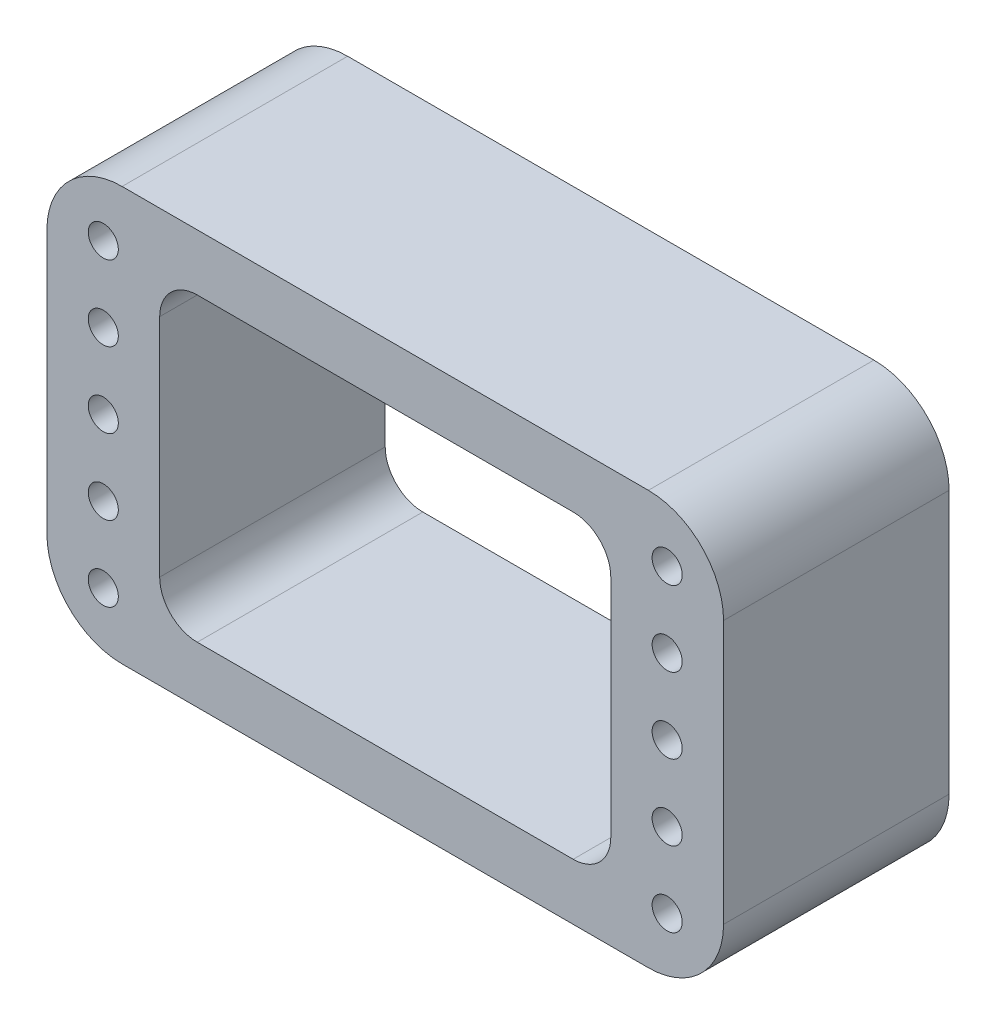
ISO-10303-21;
HEADER;
FILE_DESCRIPTION(('STEP AP214'),'2;1');
FILE_NAME('part.step','',(''),(''),'','','');
FILE_SCHEMA(('AUTOMOTIVE_DESIGN { 1 0 10303 214 1 1 1 1 }'));
ENDSEC;
DATA;
#1=APPLICATION_CONTEXT('core data for automotive mechanical design processes');
#2=APPLICATION_PROTOCOL_DEFINITION('international standard','automotive_design',2000,#1);
#3=PRODUCT_CONTEXT('',#1,'mechanical');
#4=PRODUCT('Part','Part','',(#3));
#5=PRODUCT_RELATED_PRODUCT_CATEGORY('part','',(#4));
#6=PRODUCT_DEFINITION_FORMATION('','',#4);
#7=PRODUCT_DEFINITION_CONTEXT('part definition',#1,'design');
#8=PRODUCT_DEFINITION('design','',#6,#7);
#9=PRODUCT_DEFINITION_SHAPE('','',#8);
#10=(LENGTH_UNIT() NAMED_UNIT(*) SI_UNIT(.MILLI.,.METRE.));
#11=(NAMED_UNIT(*) PLANE_ANGLE_UNIT() SI_UNIT($,.RADIAN.));
#12=(NAMED_UNIT(*) SI_UNIT($,.STERADIAN.) SOLID_ANGLE_UNIT());
#13=UNCERTAINTY_MEASURE_WITH_UNIT(LENGTH_MEASURE(1.E-05),#10,'distance_accuracy_value','');
#14=(GEOMETRIC_REPRESENTATION_CONTEXT(3) GLOBAL_UNCERTAINTY_ASSIGNED_CONTEXT((#13)) GLOBAL_UNIT_ASSIGNED_CONTEXT((#10,
#11,#12)) REPRESENTATION_CONTEXT('',''));
#15=CARTESIAN_POINT('',(0.,0.,0.));
#16=DIRECTION('',(0.,0.,1.));
#17=DIRECTION('',(1.,0.,0.));
#18=AXIS2_PLACEMENT_3D('',#15,#16,#17);
#19=CARTESIAN_POINT('',(45.,27.5,30.));
#20=DIRECTION('',(-1.,0.,0.));
#21=DIRECTION('',(0.,-1.,0.));
#22=AXIS2_PLACEMENT_3D('',#19,#20,#21);
#23=PLANE('',#22);
#24=DIRECTION('',(0.,1.,0.));
#25=VECTOR('',#24,1.);
#26=CARTESIAN_POINT('',(45.,27.5,0.));
#27=LINE('',#26,#25);
#28=CARTESIAN_POINT('',(45.,-17.5,0.));
#29=VERTEX_POINT('',#28);
#30=CARTESIAN_POINT('',(45.,17.5,0.));
#31=VERTEX_POINT('',#30);
#32=EDGE_CURVE('E197',#29,#31,#27,.T.);
#33=ORIENTED_EDGE('',*,*,#32,.T.);
#34=DIRECTION('',(0.,0.,-1.));
#35=VECTOR('',#34,1.);
#36=CARTESIAN_POINT('',(45.,17.5,30.));
#37=LINE('',#36,#35);
#38=CARTESIAN_POINT('',(45.,17.5,30.));
#39=VERTEX_POINT('',#38);
#40=EDGE_CURVE('E239',#31,#39,#37,.F.);
#41=ORIENTED_EDGE('',*,*,#40,.T.);
#42=DIRECTION('',(0.,1.,0.));
#43=VECTOR('',#42,1.);
#44=CARTESIAN_POINT('',(45.,27.5,30.));
#45=LINE('',#44,#43);
#46=CARTESIAN_POINT('',(45.,-17.5,30.));
#47=VERTEX_POINT('',#46);
#48=EDGE_CURVE('E195',#47,#39,#45,.T.);
#49=ORIENTED_EDGE('',*,*,#48,.F.);
#50=DIRECTION('',(0.,0.,-1.));
#51=VECTOR('',#50,1.);
#52=CARTESIAN_POINT('',(45.,-17.5,30.));
#53=LINE('',#52,#51);
#54=EDGE_CURVE('E235',#47,#29,#53,.T.);
#55=ORIENTED_EDGE('',*,*,#54,.T.);
#56=EDGE_LOOP('',(#33,#41,#49,#55));
#57=FACE_BOUND('',#56,.T.);
#58=ADVANCED_FACE('F45',(#57),#23,.F.);
#59=CARTESIAN_POINT('',(-45.,27.5,30.));
#60=DIRECTION('',(0.,-1.,0.));
#61=DIRECTION('',(0.,0.,-1.));
#62=AXIS2_PLACEMENT_3D('',#59,#60,#61);
#63=PLANE('',#62);
#64=DIRECTION('',(-1.,0.,0.));
#65=VECTOR('',#64,1.);
#66=CARTESIAN_POINT('',(-45.,27.5,0.));
#67=LINE('',#66,#65);
#68=CARTESIAN_POINT('',(35.,27.5,0.));
#69=VERTEX_POINT('',#68);
#70=CARTESIAN_POINT('',(-35.,27.5,0.));
#71=VERTEX_POINT('',#70);
#72=EDGE_CURVE('E190',#69,#71,#67,.T.);
#73=ORIENTED_EDGE('',*,*,#72,.T.);
#74=DIRECTION('',(0.,0.,-1.));
#75=VECTOR('',#74,1.);
#76=CARTESIAN_POINT('',(-35.,27.5,30.));
#77=LINE('',#76,#75);
#78=CARTESIAN_POINT('',(-35.,27.5,30.));
#79=VERTEX_POINT('',#78);
#80=EDGE_CURVE('E165',#71,#79,#77,.F.);
#81=ORIENTED_EDGE('',*,*,#80,.T.);
#82=DIRECTION('',(-1.,0.,0.));
#83=VECTOR('',#82,1.);
#84=CARTESIAN_POINT('',(-45.,27.5,30.));
#85=LINE('',#84,#83);
#86=CARTESIAN_POINT('',(35.,27.5,30.));
#87=VERTEX_POINT('',#86);
#88=EDGE_CURVE('E335',#87,#79,#85,.T.);
#89=ORIENTED_EDGE('',*,*,#88,.F.);
#90=DIRECTION('',(0.,0.,-1.));
#91=VECTOR('',#90,1.);
#92=CARTESIAN_POINT('',(35.,27.5,30.));
#93=LINE('',#92,#91);
#94=EDGE_CURVE('E171',#87,#69,#93,.T.);
#95=ORIENTED_EDGE('',*,*,#94,.T.);
#96=EDGE_LOOP('',(#73,#81,#89,#95));
#97=FACE_BOUND('',#96,.T.);
#98=ADVANCED_FACE('F356',(#97),#63,.F.);
#99=CARTESIAN_POINT('',(-45.,27.5,30.));
#100=DIRECTION('',(1.,0.,0.));
#101=DIRECTION('',(0.,1.,0.));
#102=AXIS2_PLACEMENT_3D('',#99,#100,#101);
#103=PLANE('',#102);
#104=DIRECTION('',(0.,-1.,0.));
#105=VECTOR('',#104,1.);
#106=CARTESIAN_POINT('',(-45.,27.5,30.));
#107=LINE('',#106,#105);
#108=CARTESIAN_POINT('',(-45.,17.5,30.));
#109=VERTEX_POINT('',#108);
#110=CARTESIAN_POINT('',(-45.,-17.5,30.));
#111=VERTEX_POINT('',#110);
#112=EDGE_CURVE('E181',#109,#111,#107,.T.);
#113=ORIENTED_EDGE('',*,*,#112,.F.);
#114=DIRECTION('',(0.,0.,-1.));
#115=VECTOR('',#114,1.);
#116=CARTESIAN_POINT('',(-45.,17.5,30.));
#117=LINE('',#116,#115);
#118=CARTESIAN_POINT('',(-45.,17.5,0.));
#119=VERTEX_POINT('',#118);
#120=EDGE_CURVE('E164',#109,#119,#117,.T.);
#121=ORIENTED_EDGE('',*,*,#120,.T.);
#122=DIRECTION('',(0.,-1.,0.));
#123=VECTOR('',#122,1.);
#124=CARTESIAN_POINT('',(-45.,27.5,0.));
#125=LINE('',#124,#123);
#126=CARTESIAN_POINT('',(-45.,-17.5,0.));
#127=VERTEX_POINT('',#126);
#128=EDGE_CURVE('E178',#119,#127,#125,.T.);
#129=ORIENTED_EDGE('',*,*,#128,.T.);
#130=DIRECTION('',(0.,0.,-1.));
#131=VECTOR('',#130,1.);
#132=CARTESIAN_POINT('',(-45.,-17.5,30.));
#133=LINE('',#132,#131);
#134=EDGE_CURVE('E184',#127,#111,#133,.F.);
#135=ORIENTED_EDGE('',*,*,#134,.T.);
#136=EDGE_LOOP('',(#113,#121,#129,#135));
#137=FACE_BOUND('',#136,.T.);
#138=ADVANCED_FACE('F177',(#137),#103,.F.);
#139=CARTESIAN_POINT('',(-45.,-27.5,30.));
#140=DIRECTION('',(0.,1.,0.));
#141=DIRECTION('',(0.,0.,1.));
#142=AXIS2_PLACEMENT_3D('',#139,#140,#141);
#143=PLANE('',#142);
#144=DIRECTION('',(1.,0.,0.));
#145=VECTOR('',#144,1.);
#146=CARTESIAN_POINT('',(-45.,-27.5,30.));
#147=LINE('',#146,#145);
#148=CARTESIAN_POINT('',(-35.,-27.5,30.));
#149=VERTEX_POINT('',#148);
#150=CARTESIAN_POINT('',(35.,-27.5,30.));
#151=VERTEX_POINT('',#150);
#152=EDGE_CURVE('E202',#149,#151,#147,.T.);
#153=ORIENTED_EDGE('',*,*,#152,.F.);
#154=DIRECTION('',(0.,0.,-1.));
#155=VECTOR('',#154,1.);
#156=CARTESIAN_POINT('',(-35.,-27.5,30.));
#157=LINE('',#156,#155);
#158=CARTESIAN_POINT('',(-35.,-27.5,0.));
#159=VERTEX_POINT('',#158);
#160=EDGE_CURVE('E231',#149,#159,#157,.T.);
#161=ORIENTED_EDGE('',*,*,#160,.T.);
#162=DIRECTION('',(1.,0.,0.));
#163=VECTOR('',#162,1.);
#164=CARTESIAN_POINT('',(-45.,-27.5,0.));
#165=LINE('',#164,#163);
#166=CARTESIAN_POINT('',(35.,-27.5,0.));
#167=VERTEX_POINT('',#166);
#168=EDGE_CURVE('E189',#159,#167,#165,.T.);
#169=ORIENTED_EDGE('',*,*,#168,.T.);
#170=DIRECTION('',(0.,0.,-1.));
#171=VECTOR('',#170,1.);
#172=CARTESIAN_POINT('',(35.,-27.5,30.));
#173=LINE('',#172,#171);
#174=EDGE_CURVE('E228',#167,#151,#173,.F.);
#175=ORIENTED_EDGE('',*,*,#174,.T.);
#176=EDGE_LOOP('',(#153,#161,#169,#175));
#177=FACE_BOUND('',#176,.T.);
#178=ADVANCED_FACE('F363',(#177),#143,.F.);
#179=CARTESIAN_POINT('',(0.,0.,30.));
#180=DIRECTION('',(0.,0.,1.));
#181=DIRECTION('',(1.,0.,0.));
#182=AXIS2_PLACEMENT_3D('',#179,#180,#181);
#183=PLANE('',#182);
#184=CARTESIAN_POINT('',(-37.5,-20.,30.));
#185=DIRECTION('',(0.,0.,-1.));
#186=DIRECTION('',(-1.,0.,0.));
#187=AXIS2_PLACEMENT_3D('',#184,#185,#186);
#188=CIRCLE('',#187,2.);
#189=CARTESIAN_POINT('',(-39.5,-20.,30.));
#190=VERTEX_POINT('',#189);
#191=EDGE_CURVE('E468',#190,#190,#188,.T.);
#192=ORIENTED_EDGE('',*,*,#191,.T.);
#193=EDGE_LOOP('',(#192));
#194=FACE_BOUND('',#193,.T.);
#195=CARTESIAN_POINT('',(-37.5,10.,30.));
#196=DIRECTION('',(0.,0.,-1.));
#197=DIRECTION('',(-1.,0.,0.));
#198=AXIS2_PLACEMENT_3D('',#195,#196,#197);
#199=CIRCLE('',#198,2.);
#200=CARTESIAN_POINT('',(-39.5,10.,30.));
#201=VERTEX_POINT('',#200);
#202=EDGE_CURVE('E469',#201,#201,#199,.T.);
#203=ORIENTED_EDGE('',*,*,#202,.T.);
#204=EDGE_LOOP('',(#203));
#205=FACE_BOUND('',#204,.T.);
#206=CARTESIAN_POINT('',(-37.5,20.,30.));
#207=DIRECTION('',(0.,0.,-1.));
#208=DIRECTION('',(-1.,0.,0.));
#209=AXIS2_PLACEMENT_3D('',#206,#207,#208);
#210=CIRCLE('',#209,2.);
#211=CARTESIAN_POINT('',(-39.5,20.,30.));
#212=VERTEX_POINT('',#211);
#213=EDGE_CURVE('E483',#212,#212,#210,.T.);
#214=ORIENTED_EDGE('',*,*,#213,.T.);
#215=EDGE_LOOP('',(#214));
#216=FACE_BOUND('',#215,.T.);
#217=CARTESIAN_POINT('',(-37.5,-9.99999999999999,30.));
#218=DIRECTION('',(0.,0.,-1.));
#219=DIRECTION('',(-1.,0.,0.));
#220=AXIS2_PLACEMENT_3D('',#217,#218,#219);
#221=CIRCLE('',#220,2.);
#222=CARTESIAN_POINT('',(-39.5,-9.99999999999999,30.));
#223=VERTEX_POINT('',#222);
#224=EDGE_CURVE('E459',#223,#223,#221,.T.);
#225=ORIENTED_EDGE('',*,*,#224,.T.);
#226=EDGE_LOOP('',(#225));
#227=FACE_BOUND('',#226,.T.);
#228=CARTESIAN_POINT('',(37.5,-20.,30.));
#229=DIRECTION('',(0.,0.,-1.));
#230=DIRECTION('',(-1.,0.,0.));
#231=AXIS2_PLACEMENT_3D('',#228,#229,#230);
#232=CIRCLE('',#231,2.);
#233=CARTESIAN_POINT('',(35.5,-20.,30.));
#234=VERTEX_POINT('',#233);
#235=EDGE_CURVE('E436',#234,#234,#232,.T.);
#236=ORIENTED_EDGE('',*,*,#235,.T.);
#237=EDGE_LOOP('',(#236));
#238=FACE_BOUND('',#237,.T.);
#239=CARTESIAN_POINT('',(37.5,10.,30.));
#240=DIRECTION('',(0.,0.,-1.));
#241=DIRECTION('',(-1.,0.,0.));
#242=AXIS2_PLACEMENT_3D('',#239,#240,#241);
#243=CIRCLE('',#242,2.);
#244=CARTESIAN_POINT('',(35.5,10.,30.));
#245=VERTEX_POINT('',#244);
#246=EDGE_CURVE('E437',#245,#245,#243,.T.);
#247=ORIENTED_EDGE('',*,*,#246,.T.);
#248=EDGE_LOOP('',(#247));
#249=FACE_BOUND('',#248,.T.);
#250=CARTESIAN_POINT('',(37.5,20.,30.));
#251=DIRECTION('',(0.,0.,-1.));
#252=DIRECTION('',(-1.,0.,0.));
#253=AXIS2_PLACEMENT_3D('',#250,#251,#252);
#254=CIRCLE('',#253,2.);
#255=CARTESIAN_POINT('',(35.5,20.,30.));
#256=VERTEX_POINT('',#255);
#257=EDGE_CURVE('E451',#256,#256,#254,.T.);
#258=ORIENTED_EDGE('',*,*,#257,.T.);
#259=EDGE_LOOP('',(#258));
#260=FACE_BOUND('',#259,.T.);
#261=CARTESIAN_POINT('',(37.5,-10.,30.));
#262=DIRECTION('',(0.,0.,-1.));
#263=DIRECTION('',(-1.,0.,0.));
#264=AXIS2_PLACEMENT_3D('',#261,#262,#263);
#265=CIRCLE('',#264,2.);
#266=CARTESIAN_POINT('',(35.5,-10.,30.));
#267=VERTEX_POINT('',#266);
#268=EDGE_CURVE('E427',#267,#267,#265,.T.);
#269=ORIENTED_EDGE('',*,*,#268,.T.);
#270=EDGE_LOOP('',(#269));
#271=FACE_BOUND('',#270,.T.);
#272=CARTESIAN_POINT('',(37.5,0.,30.));
#273=DIRECTION('',(0.,0.,-1.));
#274=DIRECTION('',(-1.,0.,0.));
#275=AXIS2_PLACEMENT_3D('',#272,#273,#274);
#276=CIRCLE('',#275,2.);
#277=CARTESIAN_POINT('',(35.5,0.,30.));
#278=VERTEX_POINT('',#277);
#279=EDGE_CURVE('E324',#278,#278,#276,.T.);
#280=ORIENTED_EDGE('',*,*,#279,.T.);
#281=EDGE_LOOP('',(#280));
#282=FACE_BOUND('',#281,.T.);
#283=CARTESIAN_POINT('',(-37.5,0.,30.));
#284=DIRECTION('',(0.,0.,-1.));
#285=DIRECTION('',(-1.,0.,0.));
#286=AXIS2_PLACEMENT_3D('',#283,#284,#285);
#287=CIRCLE('',#286,2.);
#288=CARTESIAN_POINT('',(-39.5,0.,30.));
#289=VERTEX_POINT('',#288);
#290=EDGE_CURVE('E408',#289,#289,#287,.T.);
#291=ORIENTED_EDGE('',*,*,#290,.T.);
#292=EDGE_LOOP('',(#291));
#293=FACE_BOUND('',#292,.T.);
#294=DIRECTION('',(0.,1.,0.));
#295=VECTOR('',#294,1.);
#296=CARTESIAN_POINT('',(30.,20.,30.));
#297=LINE('',#296,#295);
#298=CARTESIAN_POINT('',(30.,-15.,30.));
#299=VERTEX_POINT('',#298);
#300=CARTESIAN_POINT('',(30.,15.,30.));
#301=VERTEX_POINT('',#300);
#302=EDGE_CURVE('E300',#299,#301,#297,.T.);
#303=ORIENTED_EDGE('',*,*,#302,.F.);
#304=CARTESIAN_POINT('',(25.,-15.,30.));
#305=DIRECTION('',(0.,0.,1.));
#306=DIRECTION('',(1.,0.,0.));
#307=AXIS2_PLACEMENT_3D('',#304,#305,#306);
#308=CIRCLE('',#307,5.);
#309=CARTESIAN_POINT('',(25.,-20.,30.));
#310=VERTEX_POINT('',#309);
#311=EDGE_CURVE('E275',#299,#310,#308,.F.);
#312=ORIENTED_EDGE('',*,*,#311,.T.);
#313=DIRECTION('',(1.,0.,0.));
#314=VECTOR('',#313,1.);
#315=CARTESIAN_POINT('',(-30.,-20.,30.));
#316=LINE('',#315,#314);
#317=CARTESIAN_POINT('',(-25.,-20.,30.));
#318=VERTEX_POINT('',#317);
#319=EDGE_CURVE('E328',#318,#310,#316,.T.);
#320=ORIENTED_EDGE('',*,*,#319,.F.);
#321=CARTESIAN_POINT('',(-25.,-15.,30.));
#322=DIRECTION('',(0.,0.,1.));
#323=DIRECTION('',(1.,0.,0.));
#324=AXIS2_PLACEMENT_3D('',#321,#322,#323);
#325=CIRCLE('',#324,5.);
#326=CARTESIAN_POINT('',(-30.,-15.,30.));
#327=VERTEX_POINT('',#326);
#328=EDGE_CURVE('E269',#318,#327,#325,.F.);
#329=ORIENTED_EDGE('',*,*,#328,.T.);
#330=DIRECTION('',(0.,-1.,0.));
#331=VECTOR('',#330,1.);
#332=CARTESIAN_POINT('',(-30.,20.,30.));
#333=LINE('',#332,#331);
#334=CARTESIAN_POINT('',(-30.,15.,30.));
#335=VERTEX_POINT('',#334);
#336=EDGE_CURVE('E294',#335,#327,#333,.T.);
#337=ORIENTED_EDGE('',*,*,#336,.F.);
#338=CARTESIAN_POINT('',(-25.,15.,30.));
#339=DIRECTION('',(0.,0.,1.));
#340=DIRECTION('',(1.,0.,0.));
#341=AXIS2_PLACEMENT_3D('',#338,#339,#340);
#342=CIRCLE('',#341,5.);
#343=CARTESIAN_POINT('',(-25.,20.,30.));
#344=VERTEX_POINT('',#343);
#345=EDGE_CURVE('E54',#335,#344,#342,.F.);
#346=ORIENTED_EDGE('',*,*,#345,.T.);
#347=DIRECTION('',(-1.,0.,0.));
#348=VECTOR('',#347,1.);
#349=CARTESIAN_POINT('',(-30.,20.,30.));
#350=LINE('',#349,#348);
#351=CARTESIAN_POINT('',(25.,20.,30.));
#352=VERTEX_POINT('',#351);
#353=EDGE_CURVE('E292',#352,#344,#350,.T.);
#354=ORIENTED_EDGE('',*,*,#353,.F.);
#355=CARTESIAN_POINT('',(25.,15.,30.));
#356=DIRECTION('',(0.,0.,1.));
#357=DIRECTION('',(1.,0.,0.));
#358=AXIS2_PLACEMENT_3D('',#355,#356,#357);
#359=CIRCLE('',#358,5.);
#360=EDGE_CURVE('E281',#352,#301,#359,.F.);
#361=ORIENTED_EDGE('',*,*,#360,.T.);
#362=EDGE_LOOP('',(#303,#312,#320,#329,#337,#346,#354,#361));
#363=FACE_BOUND('',#362,.T.);
#364=ORIENTED_EDGE('',*,*,#88,.T.);
#365=CARTESIAN_POINT('',(-35.,17.5,30.));
#366=DIRECTION('',(0.,0.,1.));
#367=DIRECTION('',(1.,0.,0.));
#368=AXIS2_PLACEMENT_3D('',#365,#366,#367);
#369=CIRCLE('',#368,10.);
#370=EDGE_CURVE('E225',#79,#109,#369,.T.);
#371=ORIENTED_EDGE('',*,*,#370,.T.);
#372=ORIENTED_EDGE('',*,*,#112,.T.);
#373=CARTESIAN_POINT('',(-35.,-17.5,30.));
#374=DIRECTION('',(0.,0.,1.));
#375=DIRECTION('',(1.,0.,0.));
#376=AXIS2_PLACEMENT_3D('',#373,#374,#375);
#377=CIRCLE('',#376,10.);
#378=EDGE_CURVE('E222',#111,#149,#377,.T.);
#379=ORIENTED_EDGE('',*,*,#378,.T.);
#380=ORIENTED_EDGE('',*,*,#152,.T.);
#381=CARTESIAN_POINT('',(35.,-17.5,30.));
#382=DIRECTION('',(0.,0.,1.));
#383=DIRECTION('',(1.,0.,0.));
#384=AXIS2_PLACEMENT_3D('',#381,#382,#383);
#385=CIRCLE('',#384,10.);
#386=EDGE_CURVE('E216',#151,#47,#385,.T.);
#387=ORIENTED_EDGE('',*,*,#386,.T.);
#388=ORIENTED_EDGE('',*,*,#48,.T.);
#389=CARTESIAN_POINT('',(35.,17.5,30.));
#390=DIRECTION('',(0.,0.,1.));
#391=DIRECTION('',(1.,0.,0.));
#392=AXIS2_PLACEMENT_3D('',#389,#390,#391);
#393=CIRCLE('',#392,10.);
#394=EDGE_CURVE('E219',#39,#87,#393,.T.);
#395=ORIENTED_EDGE('',*,*,#394,.T.);
#396=EDGE_LOOP('',(#364,#371,#372,#379,#380,#387,#388,#395));
#397=FACE_BOUND('',#396,.T.);
#398=ADVANCED_FACE('F290',(#194,#205,#216,#227,#238,#249,#260,#271,#282,#293,#363,#397),#183,.T.);
#399=CARTESIAN_POINT('',(0.,0.,0.));
#400=DIRECTION('',(0.,0.,1.));
#401=DIRECTION('',(1.,0.,0.));
#402=AXIS2_PLACEMENT_3D('',#399,#400,#401);
#403=PLANE('',#402);
#404=CARTESIAN_POINT('',(-37.5,-20.,0.));
#405=DIRECTION('',(0.,0.,-1.));
#406=DIRECTION('',(-1.,0.,0.));
#407=AXIS2_PLACEMENT_3D('',#404,#405,#406);
#408=CIRCLE('',#407,2.);
#409=CARTESIAN_POINT('',(-39.5,-20.,0.));
#410=VERTEX_POINT('',#409);
#411=EDGE_CURVE('E463',#410,#410,#408,.T.);
#412=ORIENTED_EDGE('',*,*,#411,.F.);
#413=EDGE_LOOP('',(#412));
#414=FACE_BOUND('',#413,.T.);
#415=CARTESIAN_POINT('',(-37.5,10.,0.));
#416=DIRECTION('',(0.,0.,-1.));
#417=DIRECTION('',(-1.,0.,0.));
#418=AXIS2_PLACEMENT_3D('',#415,#416,#417);
#419=CIRCLE('',#418,2.);
#420=CARTESIAN_POINT('',(-39.5,10.,0.));
#421=VERTEX_POINT('',#420);
#422=EDGE_CURVE('E464',#421,#421,#419,.T.);
#423=ORIENTED_EDGE('',*,*,#422,.F.);
#424=EDGE_LOOP('',(#423));
#425=FACE_BOUND('',#424,.T.);
#426=CARTESIAN_POINT('',(-37.5,20.,0.));
#427=DIRECTION('',(0.,0.,-1.));
#428=DIRECTION('',(-1.,0.,0.));
#429=AXIS2_PLACEMENT_3D('',#426,#427,#428);
#430=CIRCLE('',#429,2.);
#431=CARTESIAN_POINT('',(-39.5,20.,0.));
#432=VERTEX_POINT('',#431);
#433=EDGE_CURVE('E473',#432,#432,#430,.T.);
#434=ORIENTED_EDGE('',*,*,#433,.F.);
#435=EDGE_LOOP('',(#434));
#436=FACE_BOUND('',#435,.T.);
#437=CARTESIAN_POINT('',(-37.5,-9.99999999999999,0.));
#438=DIRECTION('',(0.,0.,-1.));
#439=DIRECTION('',(-1.,0.,0.));
#440=AXIS2_PLACEMENT_3D('',#437,#438,#439);
#441=CIRCLE('',#440,2.);
#442=CARTESIAN_POINT('',(-39.5,-9.99999999999999,0.));
#443=VERTEX_POINT('',#442);
#444=EDGE_CURVE('E455',#443,#443,#441,.T.);
#445=ORIENTED_EDGE('',*,*,#444,.F.);
#446=EDGE_LOOP('',(#445));
#447=FACE_BOUND('',#446,.T.);
#448=CARTESIAN_POINT('',(37.5,-20.,0.));
#449=DIRECTION('',(0.,0.,-1.));
#450=DIRECTION('',(-1.,0.,0.));
#451=AXIS2_PLACEMENT_3D('',#448,#449,#450);
#452=CIRCLE('',#451,2.);
#453=CARTESIAN_POINT('',(35.5,-20.,0.));
#454=VERTEX_POINT('',#453);
#455=EDGE_CURVE('E431',#454,#454,#452,.T.);
#456=ORIENTED_EDGE('',*,*,#455,.F.);
#457=EDGE_LOOP('',(#456));
#458=FACE_BOUND('',#457,.T.);
#459=CARTESIAN_POINT('',(37.5,10.,0.));
#460=DIRECTION('',(0.,0.,-1.));
#461=DIRECTION('',(-1.,0.,0.));
#462=AXIS2_PLACEMENT_3D('',#459,#460,#461);
#463=CIRCLE('',#462,2.);
#464=CARTESIAN_POINT('',(35.5,10.,0.));
#465=VERTEX_POINT('',#464);
#466=EDGE_CURVE('E432',#465,#465,#463,.T.);
#467=ORIENTED_EDGE('',*,*,#466,.F.);
#468=EDGE_LOOP('',(#467));
#469=FACE_BOUND('',#468,.T.);
#470=CARTESIAN_POINT('',(37.5,20.,0.));
#471=DIRECTION('',(0.,0.,-1.));
#472=DIRECTION('',(-1.,0.,0.));
#473=AXIS2_PLACEMENT_3D('',#470,#471,#472);
#474=CIRCLE('',#473,2.);
#475=CARTESIAN_POINT('',(35.5,20.,0.));
#476=VERTEX_POINT('',#475);
#477=EDGE_CURVE('E441',#476,#476,#474,.T.);
#478=ORIENTED_EDGE('',*,*,#477,.F.);
#479=EDGE_LOOP('',(#478));
#480=FACE_BOUND('',#479,.T.);
#481=CARTESIAN_POINT('',(37.5,-10.,0.));
#482=DIRECTION('',(0.,0.,-1.));
#483=DIRECTION('',(-1.,0.,0.));
#484=AXIS2_PLACEMENT_3D('',#481,#482,#483);
#485=CIRCLE('',#484,2.);
#486=CARTESIAN_POINT('',(35.5,-10.,0.));
#487=VERTEX_POINT('',#486);
#488=EDGE_CURVE('E413',#487,#487,#485,.T.);
#489=ORIENTED_EDGE('',*,*,#488,.F.);
#490=EDGE_LOOP('',(#489));
#491=FACE_BOUND('',#490,.T.);
#492=CARTESIAN_POINT('',(37.5,0.,0.));
#493=DIRECTION('',(0.,0.,-1.));
#494=DIRECTION('',(-1.,0.,0.));
#495=AXIS2_PLACEMENT_3D('',#492,#493,#494);
#496=CIRCLE('',#495,2.);
#497=CARTESIAN_POINT('',(35.5,0.,0.));
#498=VERTEX_POINT('',#497);
#499=EDGE_CURVE('E417',#498,#498,#496,.T.);
#500=ORIENTED_EDGE('',*,*,#499,.F.);
#501=EDGE_LOOP('',(#500));
#502=FACE_BOUND('',#501,.T.);
#503=CARTESIAN_POINT('',(-37.5,0.,0.));
#504=DIRECTION('',(0.,0.,-1.));
#505=DIRECTION('',(-1.,0.,0.));
#506=AXIS2_PLACEMENT_3D('',#503,#504,#505);
#507=CIRCLE('',#506,2.);
#508=CARTESIAN_POINT('',(-39.5,0.,0.));
#509=VERTEX_POINT('',#508);
#510=EDGE_CURVE('E412',#509,#509,#507,.T.);
#511=ORIENTED_EDGE('',*,*,#510,.F.);
#512=EDGE_LOOP('',(#511));
#513=FACE_BOUND('',#512,.T.);
#514=DIRECTION('',(0.,-1.,0.));
#515=VECTOR('',#514,1.);
#516=CARTESIAN_POINT('',(-30.,20.,0.));
#517=LINE('',#516,#515);
#518=CARTESIAN_POINT('',(-30.,15.,0.));
#519=VERTEX_POINT('',#518);
#520=CARTESIAN_POINT('',(-30.,-15.,0.));
#521=VERTEX_POINT('',#520);
#522=EDGE_CURVE('E305',#519,#521,#517,.T.);
#523=ORIENTED_EDGE('',*,*,#522,.T.);
#524=CARTESIAN_POINT('',(-25.,-15.,0.));
#525=DIRECTION('',(0.,0.,1.));
#526=DIRECTION('',(1.,0.,0.));
#527=AXIS2_PLACEMENT_3D('',#524,#525,#526);
#528=CIRCLE('',#527,5.);
#529=CARTESIAN_POINT('',(-25.,-20.,0.));
#530=VERTEX_POINT('',#529);
#531=EDGE_CURVE('E272',#521,#530,#528,.T.);
#532=ORIENTED_EDGE('',*,*,#531,.T.);
#533=DIRECTION('',(1.,0.,0.));
#534=VECTOR('',#533,1.);
#535=CARTESIAN_POINT('',(-30.,-20.,0.));
#536=LINE('',#535,#534);
#537=CARTESIAN_POINT('',(25.,-20.,0.));
#538=VERTEX_POINT('',#537);
#539=EDGE_CURVE('E312',#530,#538,#536,.T.);
#540=ORIENTED_EDGE('',*,*,#539,.T.);
#541=CARTESIAN_POINT('',(25.,-15.,0.));
#542=DIRECTION('',(0.,0.,1.));
#543=DIRECTION('',(1.,0.,0.));
#544=AXIS2_PLACEMENT_3D('',#541,#542,#543);
#545=CIRCLE('',#544,5.);
#546=CARTESIAN_POINT('',(30.,-15.,0.));
#547=VERTEX_POINT('',#546);
#548=EDGE_CURVE('E278',#538,#547,#545,.T.);
#549=ORIENTED_EDGE('',*,*,#548,.T.);
#550=DIRECTION('',(0.,1.,0.));
#551=VECTOR('',#550,1.);
#552=CARTESIAN_POINT('',(30.,20.,0.));
#553=LINE('',#552,#551);
#554=CARTESIAN_POINT('',(30.,15.,0.));
#555=VERTEX_POINT('',#554);
#556=EDGE_CURVE('E318',#547,#555,#553,.T.);
#557=ORIENTED_EDGE('',*,*,#556,.T.);
#558=CARTESIAN_POINT('',(25.,15.,0.));
#559=DIRECTION('',(0.,0.,1.));
#560=DIRECTION('',(1.,0.,0.));
#561=AXIS2_PLACEMENT_3D('',#558,#559,#560);
#562=CIRCLE('',#561,5.);
#563=CARTESIAN_POINT('',(25.,20.,0.));
#564=VERTEX_POINT('',#563);
#565=EDGE_CURVE('E68',#555,#564,#562,.T.);
#566=ORIENTED_EDGE('',*,*,#565,.T.);
#567=DIRECTION('',(-1.,0.,0.));
#568=VECTOR('',#567,1.);
#569=CARTESIAN_POINT('',(-30.,20.,0.));
#570=LINE('',#569,#568);
#571=CARTESIAN_POINT('',(-25.,20.,0.));
#572=VERTEX_POINT('',#571);
#573=EDGE_CURVE('E307',#564,#572,#570,.T.);
#574=ORIENTED_EDGE('',*,*,#573,.T.);
#575=CARTESIAN_POINT('',(-25.,15.,0.));
#576=DIRECTION('',(0.,0.,1.));
#577=DIRECTION('',(1.,0.,0.));
#578=AXIS2_PLACEMENT_3D('',#575,#576,#577);
#579=CIRCLE('',#578,5.);
#580=EDGE_CURVE('E11',#572,#519,#579,.T.);
#581=ORIENTED_EDGE('',*,*,#580,.T.);
#582=EDGE_LOOP('',(#523,#532,#540,#549,#557,#566,#574,#581));
#583=FACE_BOUND('',#582,.T.);
#584=ORIENTED_EDGE('',*,*,#128,.F.);
#585=CARTESIAN_POINT('',(-35.,17.5,0.));
#586=DIRECTION('',(0.,0.,1.));
#587=DIRECTION('',(1.,0.,0.));
#588=AXIS2_PLACEMENT_3D('',#585,#586,#587);
#589=CIRCLE('',#588,10.);
#590=EDGE_CURVE('E160',#119,#71,#589,.F.);
#591=ORIENTED_EDGE('',*,*,#590,.T.);
#592=ORIENTED_EDGE('',*,*,#72,.F.);
#593=CARTESIAN_POINT('',(35.,17.5,0.));
#594=DIRECTION('',(0.,0.,1.));
#595=DIRECTION('',(1.,0.,0.));
#596=AXIS2_PLACEMENT_3D('',#593,#594,#595);
#597=CIRCLE('',#596,10.);
#598=EDGE_CURVE('E206',#69,#31,#597,.F.);
#599=ORIENTED_EDGE('',*,*,#598,.T.);
#600=ORIENTED_EDGE('',*,*,#32,.F.);
#601=CARTESIAN_POINT('',(35.,-17.5,0.));
#602=DIRECTION('',(0.,0.,1.));
#603=DIRECTION('',(1.,0.,0.));
#604=AXIS2_PLACEMENT_3D('',#601,#602,#603);
#605=CIRCLE('',#604,10.);
#606=EDGE_CURVE('E183',#29,#167,#605,.F.);
#607=ORIENTED_EDGE('',*,*,#606,.T.);
#608=ORIENTED_EDGE('',*,*,#168,.F.);
#609=CARTESIAN_POINT('',(-35.,-17.5,0.));
#610=DIRECTION('',(0.,0.,1.));
#611=DIRECTION('',(1.,0.,0.));
#612=AXIS2_PLACEMENT_3D('',#609,#610,#611);
#613=CIRCLE('',#612,10.);
#614=EDGE_CURVE('E172',#159,#127,#613,.F.);
#615=ORIENTED_EDGE('',*,*,#614,.T.);
#616=EDGE_LOOP('',(#584,#591,#592,#599,#600,#607,#608,#615));
#617=FACE_BOUND('',#616,.T.);
#618=ADVANCED_FACE('F186',(#414,#425,#436,#447,#458,#469,#480,#491,#502,#513,#583,#617),#403,.F.);
#619=CARTESIAN_POINT('',(30.,20.,0.));
#620=DIRECTION('',(1.,0.,0.));
#621=DIRECTION('',(0.,0.,-1.));
#622=AXIS2_PLACEMENT_3D('',#619,#620,#621);
#623=PLANE('',#622);
#624=ORIENTED_EDGE('',*,*,#556,.F.);
#625=DIRECTION('',(0.,0.,1.));
#626=VECTOR('',#625,1.);
#627=CARTESIAN_POINT('',(30.,-15.,30.));
#628=LINE('',#627,#626);
#629=EDGE_CURVE('E259',#547,#299,#628,.T.);
#630=ORIENTED_EDGE('',*,*,#629,.T.);
#631=ORIENTED_EDGE('',*,*,#302,.T.);
#632=DIRECTION('',(0.,0.,1.));
#633=VECTOR('',#632,1.);
#634=CARTESIAN_POINT('',(30.,15.,0.));
#635=LINE('',#634,#633);
#636=EDGE_CURVE('E256',#301,#555,#635,.F.);
#637=ORIENTED_EDGE('',*,*,#636,.T.);
#638=EDGE_LOOP('',(#624,#630,#631,#637));
#639=FACE_BOUND('',#638,.T.);
#640=ADVANCED_FACE('F397',(#639),#623,.F.);
#641=CARTESIAN_POINT('',(-30.,-20.,0.));
#642=DIRECTION('',(0.,-1.,0.));
#643=DIRECTION('',(0.,0.,-1.));
#644=AXIS2_PLACEMENT_3D('',#641,#642,#643);
#645=PLANE('',#644);
#646=ORIENTED_EDGE('',*,*,#539,.F.);
#647=DIRECTION('',(0.,0.,1.));
#648=VECTOR('',#647,1.);
#649=CARTESIAN_POINT('',(-25.,-20.,30.));
#650=LINE('',#649,#648);
#651=EDGE_CURVE('E245',#530,#318,#650,.T.);
#652=ORIENTED_EDGE('',*,*,#651,.T.);
#653=ORIENTED_EDGE('',*,*,#319,.T.);
#654=DIRECTION('',(0.,0.,1.));
#655=VECTOR('',#654,1.);
#656=CARTESIAN_POINT('',(25.,-20.,0.));
#657=LINE('',#656,#655);
#658=EDGE_CURVE('E242',#310,#538,#657,.F.);
#659=ORIENTED_EDGE('',*,*,#658,.T.);
#660=EDGE_LOOP('',(#646,#652,#653,#659));
#661=FACE_BOUND('',#660,.T.);
#662=ADVANCED_FACE('F404',(#661),#645,.F.);
#663=CARTESIAN_POINT('',(-30.,20.,0.));
#664=DIRECTION('',(-1.,0.,0.));
#665=DIRECTION('',(0.,0.,1.));
#666=AXIS2_PLACEMENT_3D('',#663,#664,#665);
#667=PLANE('',#666);
#668=ORIENTED_EDGE('',*,*,#336,.T.);
#669=DIRECTION('',(0.,0.,1.));
#670=VECTOR('',#669,1.);
#671=CARTESIAN_POINT('',(-30.,-15.,0.));
#672=LINE('',#671,#670);
#673=EDGE_CURVE('E253',#327,#521,#672,.F.);
#674=ORIENTED_EDGE('',*,*,#673,.T.);
#675=ORIENTED_EDGE('',*,*,#522,.F.);
#676=DIRECTION('',(0.,0.,1.));
#677=VECTOR('',#676,1.);
#678=CARTESIAN_POINT('',(-30.,15.,30.));
#679=LINE('',#678,#677);
#680=EDGE_CURVE('E249',#519,#335,#679,.T.);
#681=ORIENTED_EDGE('',*,*,#680,.T.);
#682=EDGE_LOOP('',(#668,#674,#675,#681));
#683=FACE_BOUND('',#682,.T.);
#684=ADVANCED_FACE('F309',(#683),#667,.F.);
#685=CARTESIAN_POINT('',(-30.,20.,0.));
#686=DIRECTION('',(0.,1.,0.));
#687=DIRECTION('',(0.,0.,1.));
#688=AXIS2_PLACEMENT_3D('',#685,#686,#687);
#689=PLANE('',#688);
#690=ORIENTED_EDGE('',*,*,#573,.F.);
#691=DIRECTION('',(0.,0.,1.));
#692=VECTOR('',#691,1.);
#693=CARTESIAN_POINT('',(25.,20.,30.));
#694=LINE('',#693,#692);
#695=EDGE_CURVE('E265',#564,#352,#694,.T.);
#696=ORIENTED_EDGE('',*,*,#695,.T.);
#697=ORIENTED_EDGE('',*,*,#353,.T.);
#698=DIRECTION('',(0.,0.,1.));
#699=VECTOR('',#698,1.);
#700=CARTESIAN_POINT('',(-25.,20.,0.));
#701=LINE('',#700,#699);
#702=EDGE_CURVE('E61',#344,#572,#701,.F.);
#703=ORIENTED_EDGE('',*,*,#702,.T.);
#704=EDGE_LOOP('',(#690,#696,#697,#703));
#705=FACE_BOUND('',#704,.T.);
#706=ADVANCED_FACE('F297',(#705),#689,.F.);
#707=CARTESIAN_POINT('',(-37.5,0.,30.));
#708=DIRECTION('',(0.,0.,-1.));
#709=DIRECTION('',(-1.,0.,0.));
#710=AXIS2_PLACEMENT_3D('',#707,#708,#709);
#711=CYLINDRICAL_SURFACE('',#710,2.);
#712=ORIENTED_EDGE('',*,*,#290,.F.);
#713=EDGE_LOOP('',(#712));
#714=FACE_BOUND('',#713,.T.);
#715=ORIENTED_EDGE('',*,*,#510,.T.);
#716=EDGE_LOOP('',(#715));
#717=FACE_BOUND('',#716,.T.);
#718=ADVANCED_FACE('F516',(#714,#717),#711,.F.);
#719=CARTESIAN_POINT('',(37.5,0.,30.));
#720=DIRECTION('',(0.,0.,-1.));
#721=DIRECTION('',(-1.,0.,0.));
#722=AXIS2_PLACEMENT_3D('',#719,#720,#721);
#723=CYLINDRICAL_SURFACE('',#722,2.);
#724=ORIENTED_EDGE('',*,*,#279,.F.);
#725=EDGE_LOOP('',(#724));
#726=FACE_BOUND('',#725,.T.);
#727=ORIENTED_EDGE('',*,*,#499,.T.);
#728=EDGE_LOOP('',(#727));
#729=FACE_BOUND('',#728,.T.);
#730=ADVANCED_FACE('F518',(#726,#729),#723,.F.);
#731=CARTESIAN_POINT('',(37.5,-10.,30.));
#732=DIRECTION('',(0.,0.,-1.));
#733=DIRECTION('',(-1.,0.,0.));
#734=AXIS2_PLACEMENT_3D('',#731,#732,#733);
#735=CYLINDRICAL_SURFACE('',#734,2.);
#736=ORIENTED_EDGE('',*,*,#268,.F.);
#737=EDGE_LOOP('',(#736));
#738=FACE_BOUND('',#737,.T.);
#739=ORIENTED_EDGE('',*,*,#488,.T.);
#740=EDGE_LOOP('',(#739));
#741=FACE_BOUND('',#740,.T.);
#742=ADVANCED_FACE('F525',(#738,#741),#735,.F.);
#743=CARTESIAN_POINT('',(37.5,20.,30.));
#744=DIRECTION('',(0.,0.,-1.));
#745=DIRECTION('',(-1.,0.,0.));
#746=AXIS2_PLACEMENT_3D('',#743,#744,#745);
#747=CYLINDRICAL_SURFACE('',#746,2.);
#748=ORIENTED_EDGE('',*,*,#257,.F.);
#749=EDGE_LOOP('',(#748));
#750=FACE_BOUND('',#749,.T.);
#751=ORIENTED_EDGE('',*,*,#477,.T.);
#752=EDGE_LOOP('',(#751));
#753=FACE_BOUND('',#752,.T.);
#754=ADVANCED_FACE('F675',(#750,#753),#747,.F.);
#755=CARTESIAN_POINT('',(37.5,10.,30.));
#756=DIRECTION('',(0.,0.,-1.));
#757=DIRECTION('',(-1.,0.,0.));
#758=AXIS2_PLACEMENT_3D('',#755,#756,#757);
#759=CYLINDRICAL_SURFACE('',#758,2.);
#760=ORIENTED_EDGE('',*,*,#246,.F.);
#761=EDGE_LOOP('',(#760));
#762=FACE_BOUND('',#761,.T.);
#763=ORIENTED_EDGE('',*,*,#466,.T.);
#764=EDGE_LOOP('',(#763));
#765=FACE_BOUND('',#764,.T.);
#766=ADVANCED_FACE('F685',(#762,#765),#759,.F.);
#767=CARTESIAN_POINT('',(37.5,-20.,30.));
#768=DIRECTION('',(0.,0.,-1.));
#769=DIRECTION('',(-1.,0.,0.));
#770=AXIS2_PLACEMENT_3D('',#767,#768,#769);
#771=CYLINDRICAL_SURFACE('',#770,2.);
#772=ORIENTED_EDGE('',*,*,#235,.F.);
#773=EDGE_LOOP('',(#772));
#774=FACE_BOUND('',#773,.T.);
#775=ORIENTED_EDGE('',*,*,#455,.T.);
#776=EDGE_LOOP('',(#775));
#777=FACE_BOUND('',#776,.T.);
#778=ADVANCED_FACE('F641',(#774,#777),#771,.F.);
#779=CARTESIAN_POINT('',(-37.5,-9.99999999999999,30.));
#780=DIRECTION('',(0.,0.,-1.));
#781=DIRECTION('',(-1.,0.,0.));
#782=AXIS2_PLACEMENT_3D('',#779,#780,#781);
#783=CYLINDRICAL_SURFACE('',#782,2.);
#784=ORIENTED_EDGE('',*,*,#224,.F.);
#785=EDGE_LOOP('',(#784));
#786=FACE_BOUND('',#785,.T.);
#787=ORIENTED_EDGE('',*,*,#444,.T.);
#788=EDGE_LOOP('',(#787));
#789=FACE_BOUND('',#788,.T.);
#790=ADVANCED_FACE('F494',(#786,#789),#783,.F.);
#791=CARTESIAN_POINT('',(-37.5,20.,30.));
#792=DIRECTION('',(0.,0.,-1.));
#793=DIRECTION('',(-1.,0.,0.));
#794=AXIS2_PLACEMENT_3D('',#791,#792,#793);
#795=CYLINDRICAL_SURFACE('',#794,2.);
#796=ORIENTED_EDGE('',*,*,#213,.F.);
#797=EDGE_LOOP('',(#796));
#798=FACE_BOUND('',#797,.T.);
#799=ORIENTED_EDGE('',*,*,#433,.T.);
#800=EDGE_LOOP('',(#799));
#801=FACE_BOUND('',#800,.T.);
#802=ADVANCED_FACE('F490',(#798,#801),#795,.F.);
#803=CARTESIAN_POINT('',(-37.5,10.,30.));
#804=DIRECTION('',(0.,0.,-1.));
#805=DIRECTION('',(-1.,0.,0.));
#806=AXIS2_PLACEMENT_3D('',#803,#804,#805);
#807=CYLINDRICAL_SURFACE('',#806,2.);
#808=ORIENTED_EDGE('',*,*,#202,.F.);
#809=EDGE_LOOP('',(#808));
#810=FACE_BOUND('',#809,.T.);
#811=ORIENTED_EDGE('',*,*,#422,.T.);
#812=EDGE_LOOP('',(#811));
#813=FACE_BOUND('',#812,.T.);
#814=ADVANCED_FACE('F493',(#810,#813),#807,.F.);
#815=CARTESIAN_POINT('',(-37.5,-20.,30.));
#816=DIRECTION('',(0.,0.,-1.));
#817=DIRECTION('',(-1.,0.,0.));
#818=AXIS2_PLACEMENT_3D('',#815,#816,#817);
#819=CYLINDRICAL_SURFACE('',#818,2.);
#820=ORIENTED_EDGE('',*,*,#191,.F.);
#821=EDGE_LOOP('',(#820));
#822=FACE_BOUND('',#821,.T.);
#823=ORIENTED_EDGE('',*,*,#411,.T.);
#824=EDGE_LOOP('',(#823));
#825=FACE_BOUND('',#824,.T.);
#826=ADVANCED_FACE('F371',(#822,#825),#819,.F.);
#827=CARTESIAN_POINT('',(-35.,17.5,30.));
#828=DIRECTION('',(0.,0.,-1.));
#829=DIRECTION('',(-1.,0.,0.));
#830=AXIS2_PLACEMENT_3D('',#827,#828,#829);
#831=CYLINDRICAL_SURFACE('',#830,10.);
#832=ORIENTED_EDGE('',*,*,#370,.F.);
#833=ORIENTED_EDGE('',*,*,#80,.F.);
#834=ORIENTED_EDGE('',*,*,#590,.F.);
#835=ORIENTED_EDGE('',*,*,#120,.F.);
#836=EDGE_LOOP('',(#832,#833,#834,#835));
#837=FACE_BOUND('',#836,.T.);
#838=ADVANCED_FACE('F163',(#837),#831,.T.);
#839=CARTESIAN_POINT('',(-35.,-17.5,30.));
#840=DIRECTION('',(0.,0.,-1.));
#841=DIRECTION('',(-1.,0.,0.));
#842=AXIS2_PLACEMENT_3D('',#839,#840,#841);
#843=CYLINDRICAL_SURFACE('',#842,10.);
#844=ORIENTED_EDGE('',*,*,#378,.F.);
#845=ORIENTED_EDGE('',*,*,#134,.F.);
#846=ORIENTED_EDGE('',*,*,#614,.F.);
#847=ORIENTED_EDGE('',*,*,#160,.F.);
#848=EDGE_LOOP('',(#844,#845,#846,#847));
#849=FACE_BOUND('',#848,.T.);
#850=ADVANCED_FACE('F370',(#849),#843,.T.);
#851=CARTESIAN_POINT('',(35.,17.5,30.));
#852=DIRECTION('',(0.,0.,-1.));
#853=DIRECTION('',(-1.,0.,0.));
#854=AXIS2_PLACEMENT_3D('',#851,#852,#853);
#855=CYLINDRICAL_SURFACE('',#854,10.);
#856=ORIENTED_EDGE('',*,*,#394,.F.);
#857=ORIENTED_EDGE('',*,*,#40,.F.);
#858=ORIENTED_EDGE('',*,*,#598,.F.);
#859=ORIENTED_EDGE('',*,*,#94,.F.);
#860=EDGE_LOOP('',(#856,#857,#858,#859));
#861=FACE_BOUND('',#860,.T.);
#862=ADVANCED_FACE('F352',(#861),#855,.T.);
#863=CARTESIAN_POINT('',(35.,-17.5,30.));
#864=DIRECTION('',(0.,0.,-1.));
#865=DIRECTION('',(-1.,0.,0.));
#866=AXIS2_PLACEMENT_3D('',#863,#864,#865);
#867=CYLINDRICAL_SURFACE('',#866,10.);
#868=ORIENTED_EDGE('',*,*,#386,.F.);
#869=ORIENTED_EDGE('',*,*,#174,.F.);
#870=ORIENTED_EDGE('',*,*,#606,.F.);
#871=ORIENTED_EDGE('',*,*,#54,.F.);
#872=EDGE_LOOP('',(#868,#869,#870,#871));
#873=FACE_BOUND('',#872,.T.);
#874=ADVANCED_FACE('F377',(#873),#867,.T.);
#875=CARTESIAN_POINT('',(-25.,-15.,0.));
#876=DIRECTION('',(0.,0.,-1.));
#877=DIRECTION('',(-1.,0.,0.));
#878=AXIS2_PLACEMENT_3D('',#875,#876,#877);
#879=CYLINDRICAL_SURFACE('',#878,5.);
#880=ORIENTED_EDGE('',*,*,#531,.F.);
#881=ORIENTED_EDGE('',*,*,#673,.F.);
#882=ORIENTED_EDGE('',*,*,#328,.F.);
#883=ORIENTED_EDGE('',*,*,#651,.F.);
#884=EDGE_LOOP('',(#880,#881,#882,#883));
#885=FACE_BOUND('',#884,.T.);
#886=ADVANCED_FACE('F380',(#885),#879,.F.);
#887=CARTESIAN_POINT('',(25.,-15.,0.));
#888=DIRECTION('',(0.,0.,-1.));
#889=DIRECTION('',(-1.,0.,0.));
#890=AXIS2_PLACEMENT_3D('',#887,#888,#889);
#891=CYLINDRICAL_SURFACE('',#890,5.);
#892=ORIENTED_EDGE('',*,*,#548,.F.);
#893=ORIENTED_EDGE('',*,*,#658,.F.);
#894=ORIENTED_EDGE('',*,*,#311,.F.);
#895=ORIENTED_EDGE('',*,*,#629,.F.);
#896=EDGE_LOOP('',(#892,#893,#894,#895));
#897=FACE_BOUND('',#896,.T.);
#898=ADVANCED_FACE('F384',(#897),#891,.F.);
#899=CARTESIAN_POINT('',(25.,15.,0.));
#900=DIRECTION('',(0.,0.,-1.));
#901=DIRECTION('',(-1.,0.,0.));
#902=AXIS2_PLACEMENT_3D('',#899,#900,#901);
#903=CYLINDRICAL_SURFACE('',#902,5.);
#904=ORIENTED_EDGE('',*,*,#565,.F.);
#905=ORIENTED_EDGE('',*,*,#636,.F.);
#906=ORIENTED_EDGE('',*,*,#360,.F.);
#907=ORIENTED_EDGE('',*,*,#695,.F.);
#908=EDGE_LOOP('',(#904,#905,#906,#907));
#909=FACE_BOUND('',#908,.T.);
#910=ADVANCED_FACE('F387',(#909),#903,.F.);
#911=CARTESIAN_POINT('',(-25.,15.,0.));
#912=DIRECTION('',(0.,0.,-1.));
#913=DIRECTION('',(-1.,0.,0.));
#914=AXIS2_PLACEMENT_3D('',#911,#912,#913);
#915=CYLINDRICAL_SURFACE('',#914,5.);
#916=ORIENTED_EDGE('',*,*,#580,.F.);
#917=ORIENTED_EDGE('',*,*,#702,.F.);
#918=ORIENTED_EDGE('',*,*,#345,.F.);
#919=ORIENTED_EDGE('',*,*,#680,.F.);
#920=EDGE_LOOP('',(#916,#917,#918,#919));
#921=FACE_BOUND('',#920,.T.);
#922=ADVANCED_FACE('F47',(#921),#915,.F.);
#923=CLOSED_SHELL('',(#58,#98,#138,#178,#398,#618,#640,#662,#684,#706,#718,#730,#742,#754,#766,
#778,#790,#802,#814,#826,#838,#850,#862,#874,#886,#898,#910,#922));
#924=MANIFOLD_SOLID_BREP('B2',#923);
#925=ADVANCED_BREP_SHAPE_REPRESENTATION('',(#18,#924),#14);
#926=SHAPE_DEFINITION_REPRESENTATION(#9,#925);
ENDSEC;
END-ISO-10303-21;
